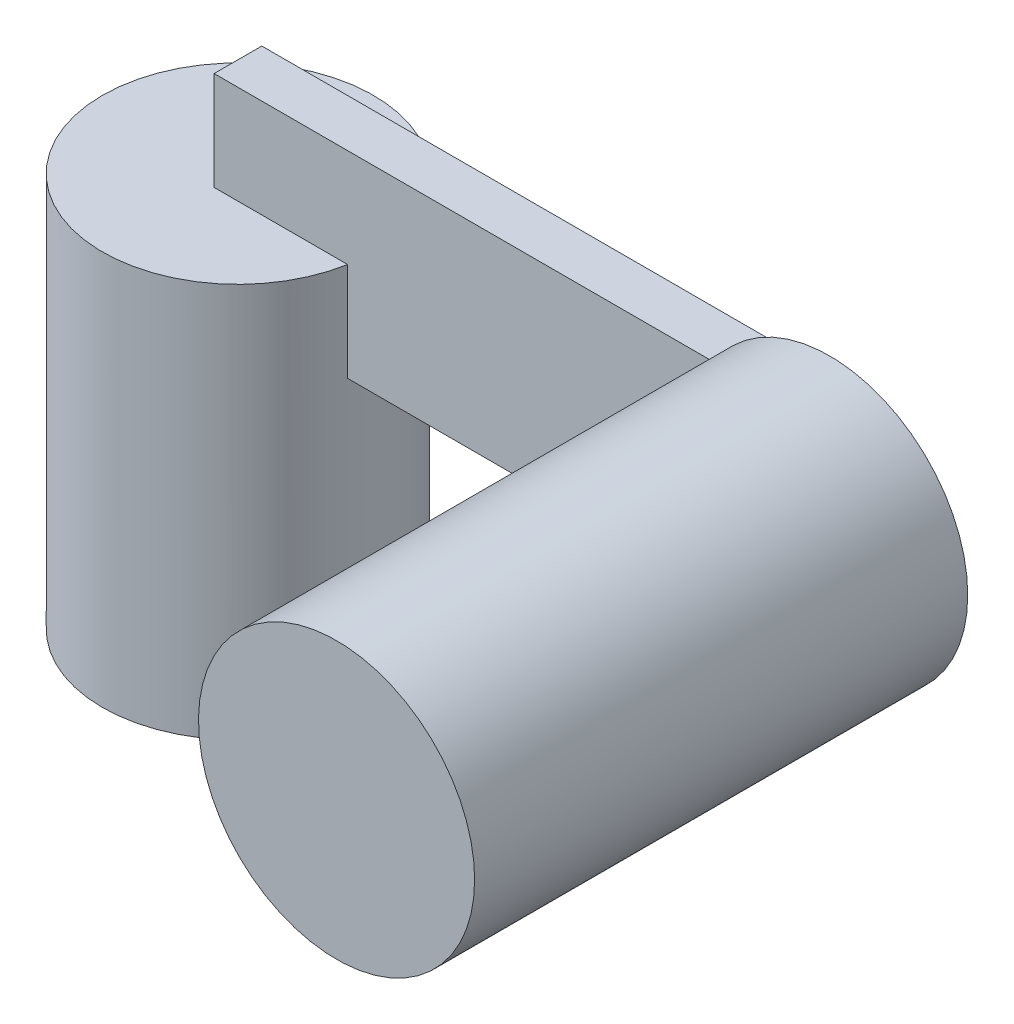
ISO-10303-21;
HEADER;
FILE_DESCRIPTION(('STEP AP214'),'2;1');
FILE_NAME('part.step','',(''),(''),'','','');
FILE_SCHEMA(('AUTOMOTIVE_DESIGN { 1 0 10303 214 1 1 1 1 }'));
ENDSEC;
DATA;
#1=APPLICATION_CONTEXT('core data for automotive mechanical design processes');
#2=APPLICATION_PROTOCOL_DEFINITION('international standard','automotive_design',2000,#1);
#3=PRODUCT_CONTEXT('',#1,'mechanical');
#4=PRODUCT('Part','Part','',(#3));
#5=PRODUCT_RELATED_PRODUCT_CATEGORY('part','',(#4));
#6=PRODUCT_DEFINITION_FORMATION('','',#4);
#7=PRODUCT_DEFINITION_CONTEXT('part definition',#1,'design');
#8=PRODUCT_DEFINITION('design','',#6,#7);
#9=PRODUCT_DEFINITION_SHAPE('','',#8);
#10=(LENGTH_UNIT() NAMED_UNIT(*) SI_UNIT(.MILLI.,.METRE.));
#11=(NAMED_UNIT(*) PLANE_ANGLE_UNIT() SI_UNIT($,.RADIAN.));
#12=(NAMED_UNIT(*) SI_UNIT($,.STERADIAN.) SOLID_ANGLE_UNIT());
#13=UNCERTAINTY_MEASURE_WITH_UNIT(LENGTH_MEASURE(1.E-05),#10,'distance_accuracy_value','');
#14=(GEOMETRIC_REPRESENTATION_CONTEXT(3) GLOBAL_UNCERTAINTY_ASSIGNED_CONTEXT((#13)) GLOBAL_UNIT_ASSIGNED_CONTEXT((#10,
#11,#12)) REPRESENTATION_CONTEXT('',''));
#15=CARTESIAN_POINT('',(0.,0.,0.));
#16=DIRECTION('',(0.,0.,1.));
#17=DIRECTION('',(1.,0.,0.));
#18=AXIS2_PLACEMENT_3D('',#15,#16,#17);
#19=CARTESIAN_POINT('',(30.,15.,1.20878285993578));
#20=DIRECTION('',(0.,1.,0.));
#21=DIRECTION('',(0.,0.,1.));
#22=AXIS2_PLACEMENT_3D('',#19,#20,#21);
#23=PLANE('',#22);
#24=DIRECTION('',(0.,0.,-1.));
#25=VECTOR('',#24,1.);
#26=CARTESIAN_POINT('',(25.1010205144336,15.,25.));
#27=LINE('',#26,#25);
#28=CARTESIAN_POINT('',(25.1010205144336,15.,1.20878285993578));
#29=VERTEX_POINT('',#28);
#30=CARTESIAN_POINT('',(25.1010205144336,15.,0.));
#31=VERTEX_POINT('',#30);
#32=EDGE_CURVE('E122',#29,#31,#27,.T.);
#33=ORIENTED_EDGE('',*,*,#32,.F.);
#34=DIRECTION('',(-1.,0.,0.));
#35=VECTOR('',#34,1.);
#36=CARTESIAN_POINT('',(30.,15.,1.20878285993578));
#37=LINE('',#36,#35);
#38=CARTESIAN_POINT('',(6.76789989564898,15.,1.20878285993578));
#39=VERTEX_POINT('',#38);
#40=EDGE_CURVE('E150',#29,#39,#37,.T.);
#41=ORIENTED_EDGE('',*,*,#40,.T.);
#42=CARTESIAN_POINT('',(0.,15.,0.));
#43=DIRECTION('',(0.,1.,0.));
#44=DIRECTION('',(0.,0.,1.));
#45=AXIS2_PLACEMENT_3D('',#42,#43,#44);
#46=CIRCLE('',#45,6.875);
#47=CARTESIAN_POINT('',(6.76789989564898,15.,-1.20878285993578));
#48=VERTEX_POINT('',#47);
#49=EDGE_CURVE('E180',#39,#48,#46,.T.);
#50=ORIENTED_EDGE('',*,*,#49,.T.);
#51=DIRECTION('',(-1.,0.,0.));
#52=VECTOR('',#51,1.);
#53=CARTESIAN_POINT('',(30.,15.,-1.20878285993578));
#54=LINE('',#53,#52);
#55=CARTESIAN_POINT('',(30.,15.,-1.20878285993578));
#56=VERTEX_POINT('',#55);
#57=EDGE_CURVE('E140',#56,#48,#54,.T.);
#58=ORIENTED_EDGE('',*,*,#57,.F.);
#59=DIRECTION('',(0.,0.,-1.));
#60=VECTOR('',#59,1.);
#61=CARTESIAN_POINT('',(30.,15.,1.20878285993578));
#62=LINE('',#61,#60);
#63=CARTESIAN_POINT('',(30.,15.,0.));
#64=VERTEX_POINT('',#63);
#65=EDGE_CURVE('E186',#64,#56,#62,.T.);
#66=ORIENTED_EDGE('',*,*,#65,.F.);
#67=DIRECTION('',(1.,0.,0.));
#68=VECTOR('',#67,1.);
#69=CARTESIAN_POINT('',(30.,15.,0.));
#70=LINE('',#69,#68);
#71=EDGE_CURVE('E59',#31,#64,#70,.T.);
#72=ORIENTED_EDGE('',*,*,#71,.F.);
#73=EDGE_LOOP('',(#33,#41,#50,#58,#66,#72));
#74=FACE_BOUND('',#73,.T.);
#75=ADVANCED_FACE('F43',(#74),#23,.F.);
#76=CARTESIAN_POINT('',(30.,25.,1.20878285993578));
#77=DIRECTION('',(0.,-1.,0.));
#78=DIRECTION('',(0.,0.,-1.));
#79=AXIS2_PLACEMENT_3D('',#76,#77,#78);
#80=PLANE('',#79);
#81=DIRECTION('',(0.,0.,-1.));
#82=VECTOR('',#81,1.);
#83=CARTESIAN_POINT('',(25.1010205144336,25.,25.));
#84=LINE('',#83,#82);
#85=CARTESIAN_POINT('',(25.1010205144336,25.,0.));
#86=VERTEX_POINT('',#85);
#87=CARTESIAN_POINT('',(25.1010205144336,25.,1.20878285993578));
#88=VERTEX_POINT('',#87);
#89=EDGE_CURVE('E11',#86,#88,#84,.F.);
#90=ORIENTED_EDGE('',*,*,#89,.F.);
#91=DIRECTION('',(-1.,0.,0.));
#92=VECTOR('',#91,1.);
#93=CARTESIAN_POINT('',(30.,25.,0.));
#94=LINE('',#93,#92);
#95=CARTESIAN_POINT('',(30.,25.,0.));
#96=VERTEX_POINT('',#95);
#97=EDGE_CURVE('E107',#96,#86,#94,.T.);
#98=ORIENTED_EDGE('',*,*,#97,.F.);
#99=DIRECTION('',(0.,0.,1.));
#100=VECTOR('',#99,1.);
#101=CARTESIAN_POINT('',(30.,25.,1.20878285993578));
#102=LINE('',#101,#100);
#103=CARTESIAN_POINT('',(30.,25.,-1.20878285993578));
#104=VERTEX_POINT('',#103);
#105=EDGE_CURVE('E136',#104,#96,#102,.T.);
#106=ORIENTED_EDGE('',*,*,#105,.F.);
#107=DIRECTION('',(-1.,0.,0.));
#108=VECTOR('',#107,1.);
#109=CARTESIAN_POINT('',(30.,25.,-1.20878285993578));
#110=LINE('',#109,#108);
#111=CARTESIAN_POINT('',(0.,25.,-1.20878285993578));
#112=VERTEX_POINT('',#111);
#113=EDGE_CURVE('E135',#104,#112,#110,.T.);
#114=ORIENTED_EDGE('',*,*,#113,.T.);
#115=DIRECTION('',(0.,0.,1.));
#116=VECTOR('',#115,1.);
#117=CARTESIAN_POINT('',(0.,25.,1.20878285993578));
#118=LINE('',#117,#116);
#119=CARTESIAN_POINT('',(0.,25.,1.20878285993578));
#120=VERTEX_POINT('',#119);
#121=EDGE_CURVE('E130',#112,#120,#118,.T.);
#122=ORIENTED_EDGE('',*,*,#121,.T.);
#123=DIRECTION('',(-1.,0.,0.));
#124=VECTOR('',#123,1.);
#125=CARTESIAN_POINT('',(30.,25.,1.20878285993578));
#126=LINE('',#125,#124);
#127=EDGE_CURVE('E128',#88,#120,#126,.T.);
#128=ORIENTED_EDGE('',*,*,#127,.F.);
#129=EDGE_LOOP('',(#90,#98,#106,#114,#122,#128));
#130=FACE_BOUND('',#129,.T.);
#131=ADVANCED_FACE('F126',(#130),#80,.F.);
#132=CARTESIAN_POINT('',(30.,0.,0.));
#133=DIRECTION('',(1.,0.,0.));
#134=DIRECTION('',(0.,0.,-1.));
#135=AXIS2_PLACEMENT_3D('',#132,#133,#134);
#136=PLANE('',#135);
#137=ORIENTED_EDGE('',*,*,#105,.T.);
#138=DIRECTION('',(0.,-1.,0.));
#139=VECTOR('',#138,1.);
#140=CARTESIAN_POINT('',(30.,0.,0.));
#141=LINE('',#140,#139);
#142=EDGE_CURVE('E52',#96,#64,#141,.T.);
#143=ORIENTED_EDGE('',*,*,#142,.T.);
#144=ORIENTED_EDGE('',*,*,#65,.T.);
#145=DIRECTION('',(0.,1.,0.));
#146=VECTOR('',#145,1.);
#147=CARTESIAN_POINT('',(30.,25.,-1.20878285993578));
#148=LINE('',#147,#146);
#149=EDGE_CURVE('E142',#56,#104,#148,.T.);
#150=ORIENTED_EDGE('',*,*,#149,.T.);
#151=EDGE_LOOP('',(#137,#143,#144,#150));
#152=FACE_BOUND('',#151,.T.);
#153=ADVANCED_FACE('F185',(#152),#136,.T.);
#154=CARTESIAN_POINT('',(0.,20.,0.));
#155=DIRECTION('',(0.,-1.,0.));
#156=DIRECTION('',(0.,0.,-1.));
#157=AXIS2_PLACEMENT_3D('',#154,#155,#156);
#158=CYLINDRICAL_SURFACE('',#157,6.875);
#159=CARTESIAN_POINT('',(0.,0.,0.));
#160=DIRECTION('',(0.,1.,0.));
#161=DIRECTION('',(0.,0.,1.));
#162=AXIS2_PLACEMENT_3D('',#159,#160,#161);
#163=CIRCLE('',#162,6.875);
#164=CARTESIAN_POINT('',(0.,0.,6.875));
#165=VERTEX_POINT('',#164);
#166=EDGE_CURVE('E160',#165,#165,#163,.T.);
#167=ORIENTED_EDGE('',*,*,#166,.T.);
#168=EDGE_LOOP('',(#167));
#169=FACE_BOUND('',#168,.T.);
#170=DIRECTION('',(0.,-1.,0.));
#171=VECTOR('',#170,1.);
#172=CARTESIAN_POINT('',(6.76789989564898,20.,1.20878285993578));
#173=LINE('',#172,#171);
#174=CARTESIAN_POINT('',(6.76789989564898,20.,1.20878285993578));
#175=VERTEX_POINT('',#174);
#176=EDGE_CURVE('E156',#175,#39,#173,.T.);
#177=ORIENTED_EDGE('',*,*,#176,.F.);
#178=CARTESIAN_POINT('',(0.,20.,0.));
#179=DIRECTION('',(0.,1.,0.));
#180=DIRECTION('',(0.,0.,1.));
#181=AXIS2_PLACEMENT_3D('',#178,#179,#180);
#182=CIRCLE('',#181,6.875);
#183=CARTESIAN_POINT('',(6.76789989564898,20.,-1.20878285993578));
#184=VERTEX_POINT('',#183);
#185=EDGE_CURVE('E161',#184,#175,#182,.T.);
#186=ORIENTED_EDGE('',*,*,#185,.F.);
#187=DIRECTION('',(0.,-1.,0.));
#188=VECTOR('',#187,1.);
#189=CARTESIAN_POINT('',(6.76789989564898,20.,-1.20878285993578));
#190=LINE('',#189,#188);
#191=EDGE_CURVE('E153',#48,#184,#190,.F.);
#192=ORIENTED_EDGE('',*,*,#191,.F.);
#193=ORIENTED_EDGE('',*,*,#49,.F.);
#194=EDGE_LOOP('',(#177,#186,#192,#193));
#195=FACE_BOUND('',#194,.T.);
#196=ADVANCED_FACE('F45',(#169,#195),#158,.T.);
#197=CARTESIAN_POINT('',(0.,20.,0.));
#198=DIRECTION('',(0.,1.,0.));
#199=DIRECTION('',(0.,0.,1.));
#200=AXIS2_PLACEMENT_3D('',#197,#198,#199);
#201=PLANE('',#200);
#202=ORIENTED_EDGE('',*,*,#185,.T.);
#203=DIRECTION('',(-1.,0.,0.));
#204=VECTOR('',#203,1.);
#205=CARTESIAN_POINT('',(0.,20.,1.20878285993578));
#206=LINE('',#205,#204);
#207=CARTESIAN_POINT('',(0.,20.,1.20878285993578));
#208=VERTEX_POINT('',#207);
#209=EDGE_CURVE('E176',#175,#208,#206,.T.);
#210=ORIENTED_EDGE('',*,*,#209,.T.);
#211=DIRECTION('',(0.,0.,-1.));
#212=VECTOR('',#211,1.);
#213=CARTESIAN_POINT('',(0.,20.,0.));
#214=LINE('',#213,#212);
#215=CARTESIAN_POINT('',(0.,20.,-1.20878285993578));
#216=VERTEX_POINT('',#215);
#217=EDGE_CURVE('E165',#208,#216,#214,.T.);
#218=ORIENTED_EDGE('',*,*,#217,.T.);
#219=DIRECTION('',(1.,0.,0.));
#220=VECTOR('',#219,1.);
#221=CARTESIAN_POINT('',(0.,20.,-1.20878285993578));
#222=LINE('',#221,#220);
#223=EDGE_CURVE('E172',#216,#184,#222,.T.);
#224=ORIENTED_EDGE('',*,*,#223,.T.);
#225=EDGE_LOOP('',(#202,#210,#218,#224));
#226=FACE_BOUND('',#225,.T.);
#227=ADVANCED_FACE('F208',(#226),#201,.T.);
#228=CARTESIAN_POINT('',(0.,0.,0.));
#229=DIRECTION('',(0.,1.,0.));
#230=DIRECTION('',(0.,0.,1.));
#231=AXIS2_PLACEMENT_3D('',#228,#229,#230);
#232=PLANE('',#231);
#233=ORIENTED_EDGE('',*,*,#166,.F.);
#234=EDGE_LOOP('',(#233));
#235=FACE_BOUND('',#234,.T.);
#236=ADVANCED_FACE('F245',(#235),#232,.F.);
#237=CARTESIAN_POINT('',(30.,25.,1.20878285993578));
#238=DIRECTION('',(0.,0.,-1.));
#239=DIRECTION('',(0.,1.,0.));
#240=AXIS2_PLACEMENT_3D('',#237,#238,#239);
#241=PLANE('',#240);
#242=CARTESIAN_POINT('',(30.,20.,1.20878285993578));
#243=DIRECTION('',(0.,0.,-1.));
#244=DIRECTION('',(0.,1.,0.));
#245=AXIS2_PLACEMENT_3D('',#242,#243,#244);
#246=CIRCLE('',#245,7.);
#247=EDGE_CURVE('E214',#88,#29,#246,.F.);
#248=ORIENTED_EDGE('',*,*,#247,.F.);
#249=ORIENTED_EDGE('',*,*,#127,.T.);
#250=DIRECTION('',(0.,-1.,0.));
#251=VECTOR('',#250,1.);
#252=CARTESIAN_POINT('',(0.,25.,1.20878285993578));
#253=LINE('',#252,#251);
#254=EDGE_CURVE('E198',#120,#208,#253,.T.);
#255=ORIENTED_EDGE('',*,*,#254,.T.);
#256=ORIENTED_EDGE('',*,*,#209,.F.);
#257=ORIENTED_EDGE('',*,*,#176,.T.);
#258=ORIENTED_EDGE('',*,*,#40,.F.);
#259=EDGE_LOOP('',(#248,#249,#255,#256,#257,#258));
#260=FACE_BOUND('',#259,.T.);
#261=ADVANCED_FACE('F205',(#260),#241,.F.);
#262=CARTESIAN_POINT('',(30.,25.,-1.20878285993578));
#263=DIRECTION('',(0.,0.,1.));
#264=DIRECTION('',(0.,-1.,0.));
#265=AXIS2_PLACEMENT_3D('',#262,#263,#264);
#266=PLANE('',#265);
#267=ORIENTED_EDGE('',*,*,#57,.T.);
#268=ORIENTED_EDGE('',*,*,#191,.T.);
#269=ORIENTED_EDGE('',*,*,#223,.F.);
#270=DIRECTION('',(0.,1.,0.));
#271=VECTOR('',#270,1.);
#272=CARTESIAN_POINT('',(0.,25.,-1.20878285993578));
#273=LINE('',#272,#271);
#274=EDGE_CURVE('E67',#216,#112,#273,.T.);
#275=ORIENTED_EDGE('',*,*,#274,.T.);
#276=ORIENTED_EDGE('',*,*,#113,.F.);
#277=ORIENTED_EDGE('',*,*,#149,.F.);
#278=EDGE_LOOP('',(#267,#268,#269,#275,#276,#277));
#279=FACE_BOUND('',#278,.T.);
#280=ADVANCED_FACE('F203',(#279),#266,.F.);
#281=CARTESIAN_POINT('',(0.,0.,0.));
#282=DIRECTION('',(1.,0.,0.));
#283=DIRECTION('',(0.,0.,-1.));
#284=AXIS2_PLACEMENT_3D('',#281,#282,#283);
#285=PLANE('',#284);
#286=ORIENTED_EDGE('',*,*,#217,.F.);
#287=ORIENTED_EDGE('',*,*,#254,.F.);
#288=ORIENTED_EDGE('',*,*,#121,.F.);
#289=ORIENTED_EDGE('',*,*,#274,.F.);
#290=EDGE_LOOP('',(#286,#287,#288,#289));
#291=FACE_BOUND('',#290,.T.);
#292=ADVANCED_FACE('F204',(#291),#285,.F.);
#293=CARTESIAN_POINT('',(30.,20.,25.));
#294=DIRECTION('',(0.,0.,-1.));
#295=DIRECTION('',(-1.,0.,0.));
#296=AXIS2_PLACEMENT_3D('',#293,#294,#295);
#297=CYLINDRICAL_SURFACE('',#296,7.);
#298=CARTESIAN_POINT('',(30.,20.,25.));
#299=DIRECTION('',(0.,0.,1.));
#300=DIRECTION('',(1.,0.,0.));
#301=AXIS2_PLACEMENT_3D('',#298,#299,#300);
#302=CIRCLE('',#301,7.);
#303=CARTESIAN_POINT('',(37.,20.,25.));
#304=VERTEX_POINT('',#303);
#305=EDGE_CURVE('E116',#304,#304,#302,.T.);
#306=ORIENTED_EDGE('',*,*,#305,.F.);
#307=EDGE_LOOP('',(#306));
#308=FACE_BOUND('',#307,.T.);
#309=ORIENTED_EDGE('',*,*,#247,.T.);
#310=ORIENTED_EDGE('',*,*,#32,.T.);
#311=CARTESIAN_POINT('',(30.,20.,0.));
#312=DIRECTION('',(0.,0.,1.));
#313=DIRECTION('',(1.,0.,0.));
#314=AXIS2_PLACEMENT_3D('',#311,#312,#313);
#315=CIRCLE('',#314,7.);
#316=EDGE_CURVE('E110',#31,#86,#315,.T.);
#317=ORIENTED_EDGE('',*,*,#316,.T.);
#318=ORIENTED_EDGE('',*,*,#89,.T.);
#319=EDGE_LOOP('',(#309,#310,#317,#318));
#320=FACE_BOUND('',#319,.T.);
#321=ADVANCED_FACE('F119',(#308,#320),#297,.T.);
#322=CARTESIAN_POINT('',(30.,20.,0.));
#323=DIRECTION('',(0.,0.,1.));
#324=DIRECTION('',(1.,0.,0.));
#325=AXIS2_PLACEMENT_3D('',#322,#323,#324);
#326=PLANE('',#325);
#327=ORIENTED_EDGE('',*,*,#316,.F.);
#328=ORIENTED_EDGE('',*,*,#71,.T.);
#329=ORIENTED_EDGE('',*,*,#142,.F.);
#330=ORIENTED_EDGE('',*,*,#97,.T.);
#331=EDGE_LOOP('',(#327,#328,#329,#330));
#332=FACE_BOUND('',#331,.T.);
#333=ADVANCED_FACE('F109',(#332),#326,.F.);
#334=CARTESIAN_POINT('',(30.,20.,25.));
#335=DIRECTION('',(0.,0.,1.));
#336=DIRECTION('',(1.,0.,0.));
#337=AXIS2_PLACEMENT_3D('',#334,#335,#336);
#338=PLANE('',#337);
#339=ORIENTED_EDGE('',*,*,#305,.T.);
#340=EDGE_LOOP('',(#339));
#341=FACE_BOUND('',#340,.T.);
#342=ADVANCED_FACE('F224',(#341),#338,.T.);
#343=CLOSED_SHELL('',(#75,#131,#153,#196,#227,#236,#261,#280,#292,#321,#333,#342));
#344=MANIFOLD_SOLID_BREP('B2',#343);
#345=ADVANCED_BREP_SHAPE_REPRESENTATION('',(#18,#344),#14);
#346=SHAPE_DEFINITION_REPRESENTATION(#9,#345);
ENDSEC;
END-ISO-10303-21;
